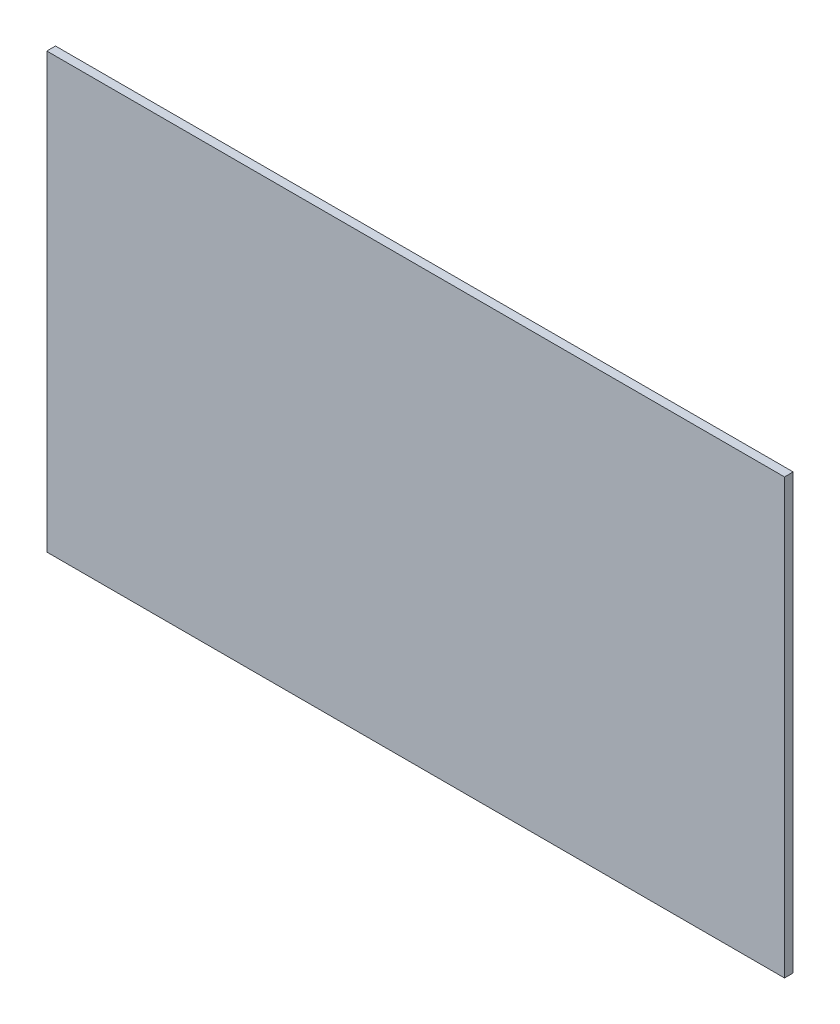
ISO-10303-21;
HEADER;
FILE_DESCRIPTION(('STEP AP214'),'2;1');
FILE_NAME('part.step','',(''),(''),'','','');
FILE_SCHEMA(('AUTOMOTIVE_DESIGN { 1 0 10303 214 1 1 1 1 }'));
ENDSEC;
DATA;
#1=APPLICATION_CONTEXT('core data for automotive mechanical design processes');
#2=APPLICATION_PROTOCOL_DEFINITION('international standard','automotive_design',2000,#1);
#3=PRODUCT_CONTEXT('',#1,'mechanical');
#4=PRODUCT('Part','Part','',(#3));
#5=PRODUCT_RELATED_PRODUCT_CATEGORY('part','',(#4));
#6=PRODUCT_DEFINITION_FORMATION('','',#4);
#7=PRODUCT_DEFINITION_CONTEXT('part definition',#1,'design');
#8=PRODUCT_DEFINITION('design','',#6,#7);
#9=PRODUCT_DEFINITION_SHAPE('','',#8);
#10=(LENGTH_UNIT() NAMED_UNIT(*) SI_UNIT(.MILLI.,.METRE.));
#11=(NAMED_UNIT(*) PLANE_ANGLE_UNIT() SI_UNIT($,.RADIAN.));
#12=(NAMED_UNIT(*) SI_UNIT($,.STERADIAN.) SOLID_ANGLE_UNIT());
#13=UNCERTAINTY_MEASURE_WITH_UNIT(LENGTH_MEASURE(1.E-05),#10,'distance_accuracy_value','');
#14=(GEOMETRIC_REPRESENTATION_CONTEXT(3) GLOBAL_UNCERTAINTY_ASSIGNED_CONTEXT((#13)) GLOBAL_UNIT_ASSIGNED_CONTEXT((#10,
#11,#12)) REPRESENTATION_CONTEXT('',''));
#15=CARTESIAN_POINT('',(0.,0.,0.));
#16=DIRECTION('',(0.,0.,1.));
#17=DIRECTION('',(1.,0.,0.));
#18=AXIS2_PLACEMENT_3D('',#15,#16,#17);
#19=CARTESIAN_POINT('',(85.,-50.,0.));
#20=DIRECTION('',(1.,0.,0.));
#21=DIRECTION('',(0.,1.,0.));
#22=AXIS2_PLACEMENT_3D('',#19,#20,#21);
#23=PLANE('',#22);
#24=DIRECTION('',(0.,0.,1.));
#25=VECTOR('',#24,1.);
#26=CARTESIAN_POINT('',(85.,-50.,0.));
#27=LINE('',#26,#25);
#28=CARTESIAN_POINT('',(85.,-50.,-2.));
#29=VERTEX_POINT('',#28);
#30=CARTESIAN_POINT('',(85.,-50.,0.));
#31=VERTEX_POINT('',#30);
#32=EDGE_CURVE('E11',#29,#31,#27,.T.);
#33=ORIENTED_EDGE('',*,*,#32,.F.);
#34=DIRECTION('',(0.,1.,0.));
#35=VECTOR('',#34,1.);
#36=CARTESIAN_POINT('',(85.,0.,-2.));
#37=LINE('',#36,#35);
#38=CARTESIAN_POINT('',(85.,50.,-2.));
#39=VERTEX_POINT('',#38);
#40=EDGE_CURVE('E91',#29,#39,#37,.T.);
#41=ORIENTED_EDGE('',*,*,#40,.T.);
#42=DIRECTION('',(0.,0.,1.));
#43=VECTOR('',#42,1.);
#44=CARTESIAN_POINT('',(85.,50.,0.));
#45=LINE('',#44,#43);
#46=CARTESIAN_POINT('',(85.,50.,0.));
#47=VERTEX_POINT('',#46);
#48=EDGE_CURVE('E47',#39,#47,#45,.T.);
#49=ORIENTED_EDGE('',*,*,#48,.T.);
#50=DIRECTION('',(0.,1.,0.));
#51=VECTOR('',#50,1.);
#52=CARTESIAN_POINT('',(85.,-50.,0.));
#53=LINE('',#52,#51);
#54=EDGE_CURVE('E104',#31,#47,#53,.T.);
#55=ORIENTED_EDGE('',*,*,#54,.F.);
#56=EDGE_LOOP('',(#33,#41,#49,#55));
#57=FACE_BOUND('',#56,.T.);
#58=ADVANCED_FACE('F37',(#57),#23,.T.);
#59=CARTESIAN_POINT('',(85.,50.,0.));
#60=DIRECTION('',(0.,1.,0.));
#61=DIRECTION('',(-1.,0.,0.));
#62=AXIS2_PLACEMENT_3D('',#59,#60,#61);
#63=PLANE('',#62);
#64=ORIENTED_EDGE('',*,*,#48,.F.);
#65=DIRECTION('',(1.,0.,0.));
#66=VECTOR('',#65,1.);
#67=CARTESIAN_POINT('',(0.,50.,-2.));
#68=LINE('',#67,#66);
#69=CARTESIAN_POINT('',(-85.,50.,-2.));
#70=VERTEX_POINT('',#69);
#71=EDGE_CURVE('E98',#39,#70,#68,.F.);
#72=ORIENTED_EDGE('',*,*,#71,.T.);
#73=DIRECTION('',(0.,0.,1.));
#74=VECTOR('',#73,1.);
#75=CARTESIAN_POINT('',(-85.,50.,0.));
#76=LINE('',#75,#74);
#77=CARTESIAN_POINT('',(-85.,50.,0.));
#78=VERTEX_POINT('',#77);
#79=EDGE_CURVE('E55',#70,#78,#76,.T.);
#80=ORIENTED_EDGE('',*,*,#79,.T.);
#81=DIRECTION('',(-1.,0.,0.));
#82=VECTOR('',#81,1.);
#83=CARTESIAN_POINT('',(85.,50.,0.));
#84=LINE('',#83,#82);
#85=EDGE_CURVE('E85',#47,#78,#84,.T.);
#86=ORIENTED_EDGE('',*,*,#85,.F.);
#87=EDGE_LOOP('',(#64,#72,#80,#86));
#88=FACE_BOUND('',#87,.T.);
#89=ADVANCED_FACE('F108',(#88),#63,.T.);
#90=CARTESIAN_POINT('',(-85.,-50.,0.));
#91=DIRECTION('',(-1.,0.,0.));
#92=DIRECTION('',(0.,-1.,0.));
#93=AXIS2_PLACEMENT_3D('',#90,#91,#92);
#94=PLANE('',#93);
#95=ORIENTED_EDGE('',*,*,#79,.F.);
#96=DIRECTION('',(0.,1.,0.));
#97=VECTOR('',#96,1.);
#98=CARTESIAN_POINT('',(-85.,0.,-2.));
#99=LINE('',#98,#97);
#100=CARTESIAN_POINT('',(-85.,-50.,-2.));
#101=VERTEX_POINT('',#100);
#102=EDGE_CURVE('E90',#70,#101,#99,.F.);
#103=ORIENTED_EDGE('',*,*,#102,.T.);
#104=DIRECTION('',(0.,0.,1.));
#105=VECTOR('',#104,1.);
#106=CARTESIAN_POINT('',(-85.,-50.,0.));
#107=LINE('',#106,#105);
#108=CARTESIAN_POINT('',(-85.,-50.,0.));
#109=VERTEX_POINT('',#108);
#110=EDGE_CURVE('E41',#101,#109,#107,.T.);
#111=ORIENTED_EDGE('',*,*,#110,.T.);
#112=DIRECTION('',(0.,-1.,0.));
#113=VECTOR('',#112,1.);
#114=CARTESIAN_POINT('',(-85.,-50.,0.));
#115=LINE('',#114,#113);
#116=EDGE_CURVE('E100',#78,#109,#115,.T.);
#117=ORIENTED_EDGE('',*,*,#116,.F.);
#118=EDGE_LOOP('',(#95,#103,#111,#117));
#119=FACE_BOUND('',#118,.T.);
#120=ADVANCED_FACE('F93',(#119),#94,.T.);
#121=CARTESIAN_POINT('',(85.,-50.,0.));
#122=DIRECTION('',(0.,-1.,0.));
#123=DIRECTION('',(1.,0.,0.));
#124=AXIS2_PLACEMENT_3D('',#121,#122,#123);
#125=PLANE('',#124);
#126=DIRECTION('',(1.,0.,0.));
#127=VECTOR('',#126,1.);
#128=CARTESIAN_POINT('',(0.,-50.,-2.));
#129=LINE('',#128,#127);
#130=EDGE_CURVE('E79',#101,#29,#129,.T.);
#131=ORIENTED_EDGE('',*,*,#130,.T.);
#132=ORIENTED_EDGE('',*,*,#32,.T.);
#133=DIRECTION('',(1.,0.,0.));
#134=VECTOR('',#133,1.);
#135=CARTESIAN_POINT('',(85.,-50.,0.));
#136=LINE('',#135,#134);
#137=EDGE_CURVE('E81',#109,#31,#136,.T.);
#138=ORIENTED_EDGE('',*,*,#137,.F.);
#139=ORIENTED_EDGE('',*,*,#110,.F.);
#140=EDGE_LOOP('',(#131,#132,#138,#139));
#141=FACE_BOUND('',#140,.T.);
#142=ADVANCED_FACE('F39',(#141),#125,.T.);
#143=CARTESIAN_POINT('',(0.,0.,0.));
#144=DIRECTION('',(0.,0.,1.));
#145=DIRECTION('',(1.,0.,0.));
#146=AXIS2_PLACEMENT_3D('',#143,#144,#145);
#147=PLANE('',#146);
#148=ORIENTED_EDGE('',*,*,#116,.T.);
#149=ORIENTED_EDGE('',*,*,#137,.T.);
#150=ORIENTED_EDGE('',*,*,#54,.T.);
#151=ORIENTED_EDGE('',*,*,#85,.T.);
#152=EDGE_LOOP('',(#148,#149,#150,#151));
#153=FACE_BOUND('',#152,.T.);
#154=ADVANCED_FACE('F107',(#153),#147,.T.);
#155=CARTESIAN_POINT('',(0.,0.,-2.));
#156=DIRECTION('',(0.,0.,1.));
#157=DIRECTION('',(1.,0.,0.));
#158=AXIS2_PLACEMENT_3D('',#155,#156,#157);
#159=PLANE('',#158);
#160=ORIENTED_EDGE('',*,*,#102,.F.);
#161=ORIENTED_EDGE('',*,*,#71,.F.);
#162=ORIENTED_EDGE('',*,*,#40,.F.);
#163=ORIENTED_EDGE('',*,*,#130,.F.);
#164=EDGE_LOOP('',(#160,#161,#162,#163));
#165=FACE_BOUND('',#164,.T.);
#166=ADVANCED_FACE('F88',(#165),#159,.F.);
#167=CLOSED_SHELL('',(#58,#89,#120,#142,#154,#166));
#168=MANIFOLD_SOLID_BREP('B2',#167);
#169=ADVANCED_BREP_SHAPE_REPRESENTATION('',(#18,#168),#14);
#170=SHAPE_DEFINITION_REPRESENTATION(#9,#169);
ENDSEC;
END-ISO-10303-21;
